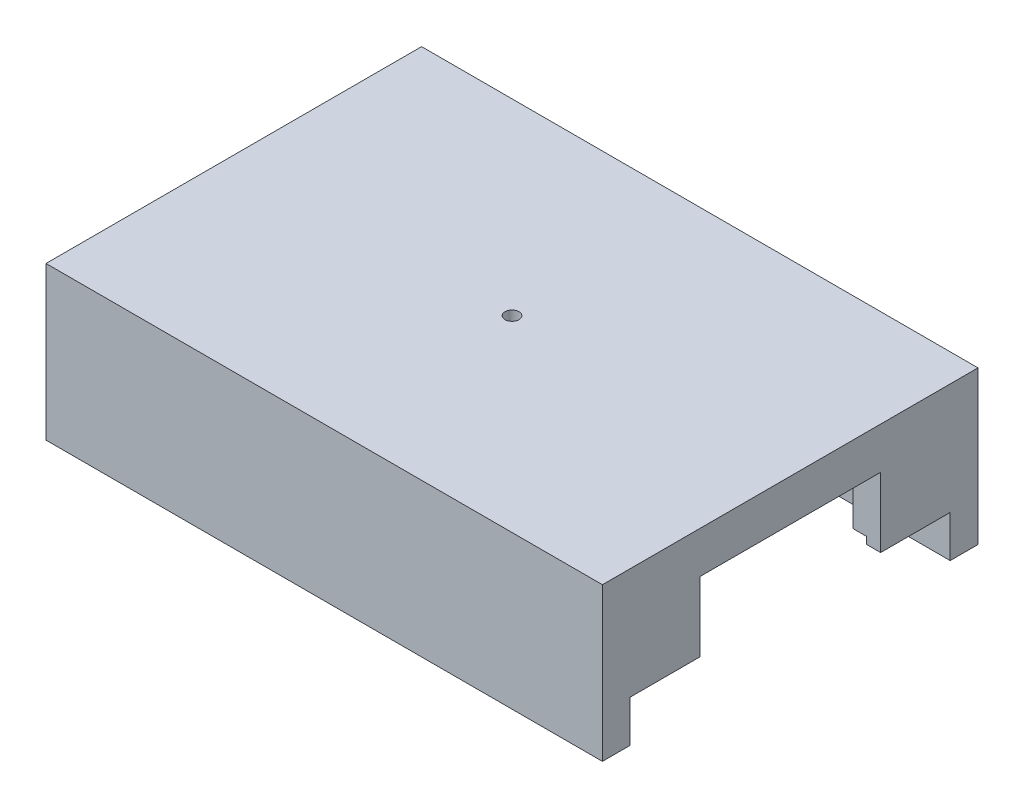
ISO-10303-21;
HEADER;
FILE_DESCRIPTION(('STEP AP214'),'2;1');
FILE_NAME('part.step','',(''),(''),'','','');
FILE_SCHEMA(('AUTOMOTIVE_DESIGN { 1 0 10303 214 1 1 1 1 }'));
ENDSEC;
DATA;
#1=APPLICATION_CONTEXT('core data for automotive mechanical design processes');
#2=APPLICATION_PROTOCOL_DEFINITION('international standard','automotive_design',2000,#1);
#3=PRODUCT_CONTEXT('',#1,'mechanical');
#4=PRODUCT('Part','Part','',(#3));
#5=PRODUCT_RELATED_PRODUCT_CATEGORY('part','',(#4));
#6=PRODUCT_DEFINITION_FORMATION('','',#4);
#7=PRODUCT_DEFINITION_CONTEXT('part definition',#1,'design');
#8=PRODUCT_DEFINITION('design','',#6,#7);
#9=PRODUCT_DEFINITION_SHAPE('','',#8);
#10=(LENGTH_UNIT() NAMED_UNIT(*) SI_UNIT(.MILLI.,.METRE.));
#11=(NAMED_UNIT(*) PLANE_ANGLE_UNIT() SI_UNIT($,.RADIAN.));
#12=(NAMED_UNIT(*) SI_UNIT($,.STERADIAN.) SOLID_ANGLE_UNIT());
#13=UNCERTAINTY_MEASURE_WITH_UNIT(LENGTH_MEASURE(1.E-05),#10,'distance_accuracy_value','');
#14=(GEOMETRIC_REPRESENTATION_CONTEXT(3) GLOBAL_UNCERTAINTY_ASSIGNED_CONTEXT((#13)) GLOBAL_UNIT_ASSIGNED_CONTEXT((#10,
#11,#12)) REPRESENTATION_CONTEXT('',''));
#15=CARTESIAN_POINT('',(0.,0.,0.));
#16=DIRECTION('',(0.,0.,1.));
#17=DIRECTION('',(1.,0.,0.));
#18=AXIS2_PLACEMENT_3D('',#15,#16,#17);
#19=CARTESIAN_POINT('',(0.,-11.,11.5));
#20=DIRECTION('',(0.,0.,-1.));
#21=DIRECTION('',(-1.,0.,0.));
#22=AXIS2_PLACEMENT_3D('',#19,#20,#21);
#23=PLANE('',#22);
#24=DIRECTION('',(-1.,0.,0.));
#25=VECTOR('',#24,1.);
#26=CARTESIAN_POINT('',(-20.,-8.,11.5));
#27=LINE('',#26,#25);
#28=CARTESIAN_POINT('',(-19.,-8.,11.5));
#29=VERTEX_POINT('',#28);
#30=CARTESIAN_POINT('',(-20.,-8.,11.5));
#31=VERTEX_POINT('',#30);
#32=EDGE_CURVE('E267',#29,#31,#27,.T.);
#33=ORIENTED_EDGE('',*,*,#32,.F.);
#34=DIRECTION('',(0.,-1.,0.));
#35=VECTOR('',#34,1.);
#36=CARTESIAN_POINT('',(-19.,0.,11.5));
#37=LINE('',#36,#35);
#38=CARTESIAN_POINT('',(-19.,-8.5,11.5));
#39=VERTEX_POINT('',#38);
#40=EDGE_CURVE('E51',#29,#39,#37,.T.);
#41=ORIENTED_EDGE('',*,*,#40,.T.);
#42=DIRECTION('',(-1.,0.,0.));
#43=VECTOR('',#42,1.);
#44=CARTESIAN_POINT('',(0.,-8.5,11.5));
#45=LINE('',#44,#43);
#46=CARTESIAN_POINT('',(19.,-8.5,11.5));
#47=VERTEX_POINT('',#46);
#48=EDGE_CURVE('E528',#47,#39,#45,.T.);
#49=ORIENTED_EDGE('',*,*,#48,.F.);
#50=DIRECTION('',(0.,-1.,0.));
#51=VECTOR('',#50,1.);
#52=CARTESIAN_POINT('',(19.,0.,11.5));
#53=LINE('',#52,#51);
#54=CARTESIAN_POINT('',(19.,-8.,11.5));
#55=VERTEX_POINT('',#54);
#56=EDGE_CURVE('E539',#55,#47,#53,.T.);
#57=ORIENTED_EDGE('',*,*,#56,.F.);
#58=DIRECTION('',(-1.,0.,0.));
#59=VECTOR('',#58,1.);
#60=CARTESIAN_POINT('',(20.,-8.,11.5));
#61=LINE('',#60,#59);
#62=CARTESIAN_POINT('',(20.,-8.,11.5));
#63=VERTEX_POINT('',#62);
#64=EDGE_CURVE('E330',#63,#55,#61,.T.);
#65=ORIENTED_EDGE('',*,*,#64,.F.);
#66=DIRECTION('',(0.,1.,0.));
#67=VECTOR('',#66,1.);
#68=CARTESIAN_POINT('',(20.,-11.,11.5));
#69=LINE('',#68,#67);
#70=CARTESIAN_POINT('',(20.,-11.,11.5));
#71=VERTEX_POINT('',#70);
#72=EDGE_CURVE('E365',#71,#63,#69,.T.);
#73=ORIENTED_EDGE('',*,*,#72,.F.);
#74=DIRECTION('',(-1.,0.,0.));
#75=VECTOR('',#74,1.);
#76=CARTESIAN_POINT('',(0.,-11.,11.5));
#77=LINE('',#76,#75);
#78=CARTESIAN_POINT('',(-20.,-11.,11.5));
#79=VERTEX_POINT('',#78);
#80=EDGE_CURVE('E347',#71,#79,#77,.T.);
#81=ORIENTED_EDGE('',*,*,#80,.T.);
#82=DIRECTION('',(0.,1.,0.));
#83=VECTOR('',#82,1.);
#84=CARTESIAN_POINT('',(-20.,-11.,11.5));
#85=LINE('',#84,#83);
#86=EDGE_CURVE('E356',#79,#31,#85,.T.);
#87=ORIENTED_EDGE('',*,*,#86,.T.);
#88=EDGE_LOOP('',(#33,#41,#49,#57,#65,#73,#81,#87));
#89=FACE_BOUND('',#88,.T.);
#90=ADVANCED_FACE('F34',(#89),#23,.T.);
#91=DIRECTION('',(0.,1.,0.));
#92=VECTOR('',#91,1.);
#93=CARTESIAN_POINT('',(18.,-8.,11.5));
#94=LINE('',#93,#92);
#95=CARTESIAN_POINT('',(18.,-7.5,11.5));
#96=VERTEX_POINT('',#95);
#97=CARTESIAN_POINT('',(18.,-3.,11.5));
#98=VERTEX_POINT('',#97);
#99=EDGE_CURVE('E344',#96,#98,#94,.T.);
#100=ORIENTED_EDGE('',*,*,#99,.F.);
#101=DIRECTION('',(-1.,0.,0.));
#102=VECTOR('',#101,1.);
#103=CARTESIAN_POINT('',(0.,-7.5,11.5));
#104=LINE('',#103,#102);
#105=CARTESIAN_POINT('',(-18.,-7.5,11.5));
#106=VERTEX_POINT('',#105);
#107=EDGE_CURVE('E510',#96,#106,#104,.T.);
#108=ORIENTED_EDGE('',*,*,#107,.T.);
#109=DIRECTION('',(0.,1.,0.));
#110=VECTOR('',#109,1.);
#111=CARTESIAN_POINT('',(-18.,-8.,11.5));
#112=LINE('',#111,#110);
#113=CARTESIAN_POINT('',(-18.,-3.,11.5));
#114=VERTEX_POINT('',#113);
#115=EDGE_CURVE('E269',#106,#114,#112,.T.);
#116=ORIENTED_EDGE('',*,*,#115,.T.);
#117=DIRECTION('',(-1.,0.,0.));
#118=VECTOR('',#117,1.);
#119=CARTESIAN_POINT('',(0.,-3.,11.5));
#120=LINE('',#119,#118);
#121=EDGE_CURVE('E346',#98,#114,#120,.T.);
#122=ORIENTED_EDGE('',*,*,#121,.F.);
#123=EDGE_LOOP('',(#100,#108,#116,#122));
#124=FACE_BOUND('',#123,.T.);
#125=ADVANCED_FACE('F423',(#124),#23,.T.);
#126=CARTESIAN_POINT('',(18.,-8.,11.5));
#127=DIRECTION('',(1.,0.,0.));
#128=DIRECTION('',(0.,0.,-1.));
#129=AXIS2_PLACEMENT_3D('',#126,#127,#128);
#130=PLANE('',#129);
#131=DIRECTION('',(0.,0.,-1.));
#132=VECTOR('',#131,1.);
#133=CARTESIAN_POINT('',(18.,-7.5,-13.501));
#134=LINE('',#133,#132);
#135=CARTESIAN_POINT('',(18.,-7.5,6.5));
#136=VERTEX_POINT('',#135);
#137=EDGE_CURVE('E508',#96,#136,#134,.T.);
#138=ORIENTED_EDGE('',*,*,#137,.F.);
#139=ORIENTED_EDGE('',*,*,#99,.T.);
#140=DIRECTION('',(0.,0.,-1.));
#141=VECTOR('',#140,1.);
#142=CARTESIAN_POINT('',(18.,-3.,11.5));
#143=LINE('',#142,#141);
#144=CARTESIAN_POINT('',(18.,-3.,6.5));
#145=VERTEX_POINT('',#144);
#146=EDGE_CURVE('E327',#98,#145,#143,.T.);
#147=ORIENTED_EDGE('',*,*,#146,.T.);
#148=DIRECTION('',(0.,1.,0.));
#149=VECTOR('',#148,1.);
#150=CARTESIAN_POINT('',(18.,-8.,6.5));
#151=LINE('',#150,#149);
#152=EDGE_CURVE('E342',#136,#145,#151,.T.);
#153=ORIENTED_EDGE('',*,*,#152,.F.);
#154=EDGE_LOOP('',(#138,#139,#147,#153));
#155=FACE_BOUND('',#154,.T.);
#156=ADVANCED_FACE('F429',(#155),#130,.F.);
#157=CARTESIAN_POINT('',(-20.,-8.,6.5));
#158=DIRECTION('',(0.,0.,1.));
#159=DIRECTION('',(1.,0.,0.));
#160=AXIS2_PLACEMENT_3D('',#157,#158,#159);
#161=PLANE('',#160);
#162=DIRECTION('',(0.,1.,0.));
#163=VECTOR('',#162,1.);
#164=CARTESIAN_POINT('',(-19.,0.,6.5));
#165=LINE('',#164,#163);
#166=CARTESIAN_POINT('',(-19.,-8.,6.5));
#167=VERTEX_POINT('',#166);
#168=CARTESIAN_POINT('',(-19.,-7.5,6.5));
#169=VERTEX_POINT('',#168);
#170=EDGE_CURVE('E247',#167,#169,#165,.T.);
#171=ORIENTED_EDGE('',*,*,#170,.F.);
#172=DIRECTION('',(1.,0.,0.));
#173=VECTOR('',#172,1.);
#174=CARTESIAN_POINT('',(-20.,-8.,6.5));
#175=LINE('',#174,#173);
#176=CARTESIAN_POINT('',(-20.,-8.,6.5));
#177=VERTEX_POINT('',#176);
#178=EDGE_CURVE('E258',#177,#167,#175,.T.);
#179=ORIENTED_EDGE('',*,*,#178,.F.);
#180=DIRECTION('',(0.,1.,0.));
#181=VECTOR('',#180,1.);
#182=CARTESIAN_POINT('',(-20.,-8.,6.5));
#183=LINE('',#182,#181);
#184=CARTESIAN_POINT('',(-20.,-3.,6.5));
#185=VERTEX_POINT('',#184);
#186=EDGE_CURVE('E284',#177,#185,#183,.T.);
#187=ORIENTED_EDGE('',*,*,#186,.T.);
#188=DIRECTION('',(1.,0.,0.));
#189=VECTOR('',#188,1.);
#190=CARTESIAN_POINT('',(-20.,-3.,6.5));
#191=LINE('',#190,#189);
#192=CARTESIAN_POINT('',(-18.,-3.,6.5));
#193=VERTEX_POINT('',#192);
#194=EDGE_CURVE('E275',#185,#193,#191,.T.);
#195=ORIENTED_EDGE('',*,*,#194,.T.);
#196=DIRECTION('',(0.,1.,0.));
#197=VECTOR('',#196,1.);
#198=CARTESIAN_POINT('',(-18.,-8.,6.5));
#199=LINE('',#198,#197);
#200=CARTESIAN_POINT('',(-18.,-7.5,6.5));
#201=VERTEX_POINT('',#200);
#202=EDGE_CURVE('E282',#201,#193,#199,.T.);
#203=ORIENTED_EDGE('',*,*,#202,.F.);
#204=DIRECTION('',(1.,0.,0.));
#205=VECTOR('',#204,1.);
#206=CARTESIAN_POINT('',(0.,-7.5,6.49999999999999));
#207=LINE('',#206,#205);
#208=EDGE_CURVE('E253',#169,#201,#207,.T.);
#209=ORIENTED_EDGE('',*,*,#208,.F.);
#210=EDGE_LOOP('',(#171,#179,#187,#195,#203,#209));
#211=FACE_BOUND('',#210,.T.);
#212=ADVANCED_FACE('F256',(#211),#161,.F.);
#213=CARTESIAN_POINT('',(-18.,-8.,11.5));
#214=DIRECTION('',(-1.,0.,0.));
#215=DIRECTION('',(0.,0.,1.));
#216=AXIS2_PLACEMENT_3D('',#213,#214,#215);
#217=PLANE('',#216);
#218=DIRECTION('',(0.,0.,1.));
#219=VECTOR('',#218,1.);
#220=CARTESIAN_POINT('',(-18.,-7.5,-13.501));
#221=LINE('',#220,#219);
#222=EDGE_CURVE('E261',#201,#106,#221,.T.);
#223=ORIENTED_EDGE('',*,*,#222,.F.);
#224=ORIENTED_EDGE('',*,*,#202,.T.);
#225=DIRECTION('',(0.,0.,1.));
#226=VECTOR('',#225,1.);
#227=CARTESIAN_POINT('',(-18.,-3.,11.5));
#228=LINE('',#227,#226);
#229=EDGE_CURVE('E271',#193,#114,#228,.T.);
#230=ORIENTED_EDGE('',*,*,#229,.T.);
#231=ORIENTED_EDGE('',*,*,#115,.F.);
#232=EDGE_LOOP('',(#223,#224,#230,#231));
#233=FACE_BOUND('',#232,.T.);
#234=ADVANCED_FACE('F514',(#233),#217,.F.);
#235=CARTESIAN_POINT('',(0.,-8.,0.));
#236=DIRECTION('',(0.,-1.,0.));
#237=DIRECTION('',(0.,0.,-1.));
#238=AXIS2_PLACEMENT_3D('',#235,#236,#237);
#239=PLANE('',#238);
#240=ORIENTED_EDGE('',*,*,#178,.T.);
#241=DIRECTION('',(0.,0.,1.));
#242=VECTOR('',#241,1.);
#243=CARTESIAN_POINT('',(-19.,-8.,-13.501));
#244=LINE('',#243,#242);
#245=EDGE_CURVE('E243',#167,#29,#244,.T.);
#246=ORIENTED_EDGE('',*,*,#245,.T.);
#247=ORIENTED_EDGE('',*,*,#32,.T.);
#248=DIRECTION('',(0.,0.,-1.));
#249=VECTOR('',#248,1.);
#250=CARTESIAN_POINT('',(-20.,-8.,11.5));
#251=LINE('',#250,#249);
#252=EDGE_CURVE('E265',#31,#177,#251,.T.);
#253=ORIENTED_EDGE('',*,*,#252,.T.);
#254=EDGE_LOOP('',(#240,#246,#247,#253));
#255=FACE_BOUND('',#254,.T.);
#256=ADVANCED_FACE('F263',(#255),#239,.T.);
#257=CARTESIAN_POINT('',(0.,-11.,-11.5));
#258=DIRECTION('',(0.,0.,-1.));
#259=DIRECTION('',(-1.,0.,0.));
#260=AXIS2_PLACEMENT_3D('',#257,#258,#259);
#261=PLANE('',#260);
#262=DIRECTION('',(0.,1.,0.));
#263=VECTOR('',#262,1.);
#264=CARTESIAN_POINT('',(-18.,-8.,-11.5));
#265=LINE('',#264,#263);
#266=CARTESIAN_POINT('',(-18.,-7.5,-11.5));
#267=VERTEX_POINT('',#266);
#268=CARTESIAN_POINT('',(-18.,-3.,-11.5));
#269=VERTEX_POINT('',#268);
#270=EDGE_CURVE('E305',#267,#269,#265,.T.);
#271=ORIENTED_EDGE('',*,*,#270,.F.);
#272=DIRECTION('',(-1.,0.,0.));
#273=VECTOR('',#272,1.);
#274=CARTESIAN_POINT('',(0.,-7.5,-11.5));
#275=LINE('',#274,#273);
#276=CARTESIAN_POINT('',(18.,-7.5,-11.5));
#277=VERTEX_POINT('',#276);
#278=EDGE_CURVE('E474',#277,#267,#275,.T.);
#279=ORIENTED_EDGE('',*,*,#278,.F.);
#280=DIRECTION('',(0.,1.,0.));
#281=VECTOR('',#280,1.);
#282=CARTESIAN_POINT('',(18.,-8.,-11.5));
#283=LINE('',#282,#281);
#284=CARTESIAN_POINT('',(18.,-3.,-11.5));
#285=VERTEX_POINT('',#284);
#286=EDGE_CURVE('E317',#277,#285,#283,.T.);
#287=ORIENTED_EDGE('',*,*,#286,.T.);
#288=DIRECTION('',(-1.,0.,0.));
#289=VECTOR('',#288,1.);
#290=CARTESIAN_POINT('',(0.,-3.,-11.5));
#291=LINE('',#290,#289);
#292=EDGE_CURVE('E368',#285,#269,#291,.T.);
#293=ORIENTED_EDGE('',*,*,#292,.T.);
#294=EDGE_LOOP('',(#271,#279,#287,#293));
#295=FACE_BOUND('',#294,.T.);
#296=ADVANCED_FACE('F442',(#295),#261,.F.);
#297=CARTESIAN_POINT('',(0.,-8.,0.));
#298=DIRECTION('',(0.,-1.,0.));
#299=DIRECTION('',(0.,0.,-1.));
#300=AXIS2_PLACEMENT_3D('',#297,#298,#299);
#301=PLANE('',#300);
#302=DIRECTION('',(-1.,0.,0.));
#303=VECTOR('',#302,1.);
#304=CARTESIAN_POINT('',(20.,-8.,-6.5));
#305=LINE('',#304,#303);
#306=CARTESIAN_POINT('',(20.,-8.,-6.5));
#307=VERTEX_POINT('',#306);
#308=CARTESIAN_POINT('',(19.,-8.,-6.5));
#309=VERTEX_POINT('',#308);
#310=EDGE_CURVE('E311',#307,#309,#305,.T.);
#311=ORIENTED_EDGE('',*,*,#310,.T.);
#312=DIRECTION('',(0.,0.,-1.));
#313=VECTOR('',#312,1.);
#314=CARTESIAN_POINT('',(19.,-8.,13.501));
#315=LINE('',#314,#313);
#316=CARTESIAN_POINT('',(19.,-8.,-11.5));
#317=VERTEX_POINT('',#316);
#318=EDGE_CURVE('E555',#309,#317,#315,.T.);
#319=ORIENTED_EDGE('',*,*,#318,.T.);
#320=DIRECTION('',(1.,0.,0.));
#321=VECTOR('',#320,1.);
#322=CARTESIAN_POINT('',(20.,-8.,-11.5));
#323=LINE('',#322,#321);
#324=CARTESIAN_POINT('',(20.,-8.,-11.5));
#325=VERTEX_POINT('',#324);
#326=EDGE_CURVE('E315',#317,#325,#323,.T.);
#327=ORIENTED_EDGE('',*,*,#326,.T.);
#328=DIRECTION('',(0.,0.,1.));
#329=VECTOR('',#328,1.);
#330=CARTESIAN_POINT('',(20.,-8.,-11.5));
#331=LINE('',#330,#329);
#332=EDGE_CURVE('E308',#325,#307,#331,.T.);
#333=ORIENTED_EDGE('',*,*,#332,.T.);
#334=EDGE_LOOP('',(#311,#319,#327,#333));
#335=FACE_BOUND('',#334,.T.);
#336=ADVANCED_FACE('F444',(#335),#301,.T.);
#337=CARTESIAN_POINT('',(0.,-3.,0.));
#338=DIRECTION('',(0.,1.,0.));
#339=DIRECTION('',(0.,0.,1.));
#340=AXIS2_PLACEMENT_3D('',#337,#338,#339);
#341=PLANE('',#340);
#342=CARTESIAN_POINT('',(0.,-3.,0.));
#343=DIRECTION('',(0.,1.,0.));
#344=DIRECTION('',(0.,0.,1.));
#345=AXIS2_PLACEMENT_3D('',#342,#343,#344);
#346=CIRCLE('',#345,0.5);
#347=CARTESIAN_POINT('',(0.,-3.,0.5));
#348=VERTEX_POINT('',#347);
#349=EDGE_CURVE('E11',#348,#348,#346,.T.);
#350=ORIENTED_EDGE('',*,*,#349,.T.);
#351=EDGE_LOOP('',(#350));
#352=FACE_BOUND('',#351,.T.);
#353=ORIENTED_EDGE('',*,*,#194,.F.);
#354=DIRECTION('',(0.,0.,-1.));
#355=VECTOR('',#354,1.);
#356=CARTESIAN_POINT('',(-20.,-3.,0.));
#357=LINE('',#356,#355);
#358=CARTESIAN_POINT('',(-20.,-3.,-6.5));
#359=VERTEX_POINT('',#358);
#360=EDGE_CURVE('E391',#185,#359,#357,.T.);
#361=ORIENTED_EDGE('',*,*,#360,.T.);
#362=DIRECTION('',(-1.,0.,0.));
#363=VECTOR('',#362,1.);
#364=CARTESIAN_POINT('',(-20.,-3.,-6.5));
#365=LINE('',#364,#363);
#366=CARTESIAN_POINT('',(-18.,-3.,-6.5));
#367=VERTEX_POINT('',#366);
#368=EDGE_CURVE('E291',#367,#359,#365,.T.);
#369=ORIENTED_EDGE('',*,*,#368,.F.);
#370=DIRECTION('',(0.,0.,1.));
#371=VECTOR('',#370,1.);
#372=CARTESIAN_POINT('',(-18.,-3.,-11.5));
#373=LINE('',#372,#371);
#374=EDGE_CURVE('E286',#269,#367,#373,.T.);
#375=ORIENTED_EDGE('',*,*,#374,.F.);
#376=ORIENTED_EDGE('',*,*,#292,.F.);
#377=DIRECTION('',(0.,0.,-1.));
#378=VECTOR('',#377,1.);
#379=CARTESIAN_POINT('',(18.,-3.,-11.5));
#380=LINE('',#379,#378);
#381=CARTESIAN_POINT('',(18.,-3.,-6.5));
#382=VERTEX_POINT('',#381);
#383=EDGE_CURVE('E312',#382,#285,#380,.T.);
#384=ORIENTED_EDGE('',*,*,#383,.F.);
#385=DIRECTION('',(-1.,0.,0.));
#386=VECTOR('',#385,1.);
#387=CARTESIAN_POINT('',(20.,-3.,-6.5));
#388=LINE('',#387,#386);
#389=CARTESIAN_POINT('',(20.,-3.,-6.5));
#390=VERTEX_POINT('',#389);
#391=EDGE_CURVE('E307',#390,#382,#388,.T.);
#392=ORIENTED_EDGE('',*,*,#391,.F.);
#393=DIRECTION('',(0.,0.,-1.));
#394=VECTOR('',#393,1.);
#395=CARTESIAN_POINT('',(20.,-3.,0.));
#396=LINE('',#395,#394);
#397=CARTESIAN_POINT('',(20.,-3.,6.5));
#398=VERTEX_POINT('',#397);
#399=EDGE_CURVE('E43',#398,#390,#396,.T.);
#400=ORIENTED_EDGE('',*,*,#399,.F.);
#401=DIRECTION('',(1.,0.,0.));
#402=VECTOR('',#401,1.);
#403=CARTESIAN_POINT('',(20.,-3.,6.5));
#404=LINE('',#403,#402);
#405=EDGE_CURVE('E331',#145,#398,#404,.T.);
#406=ORIENTED_EDGE('',*,*,#405,.F.);
#407=ORIENTED_EDGE('',*,*,#146,.F.);
#408=ORIENTED_EDGE('',*,*,#121,.T.);
#409=ORIENTED_EDGE('',*,*,#229,.F.);
#410=EDGE_LOOP('',(#353,#361,#369,#375,#376,#384,#392,#400,#406,#407,#408,#409));
#411=FACE_BOUND('',#410,.T.);
#412=ADVANCED_FACE('F440',(#352,#411),#341,.F.);
#413=DIRECTION('',(-1.,0.,0.));
#414=VECTOR('',#413,1.);
#415=CARTESIAN_POINT('',(0.,-8.5,-11.5));
#416=LINE('',#415,#414);
#417=CARTESIAN_POINT('',(19.,-8.5,-11.5));
#418=VERTEX_POINT('',#417);
#419=CARTESIAN_POINT('',(-19.,-8.5,-11.5));
#420=VERTEX_POINT('',#419);
#421=EDGE_CURVE('E579',#418,#420,#416,.T.);
#422=ORIENTED_EDGE('',*,*,#421,.T.);
#423=DIRECTION('',(0.,-1.,0.));
#424=VECTOR('',#423,1.);
#425=CARTESIAN_POINT('',(-19.,0.,-11.5));
#426=LINE('',#425,#424);
#427=CARTESIAN_POINT('',(-19.,-8.,-11.5));
#428=VERTEX_POINT('',#427);
#429=EDGE_CURVE('E566',#428,#420,#426,.T.);
#430=ORIENTED_EDGE('',*,*,#429,.F.);
#431=DIRECTION('',(1.,0.,0.));
#432=VECTOR('',#431,1.);
#433=CARTESIAN_POINT('',(-20.,-8.,-11.5));
#434=LINE('',#433,#432);
#435=CARTESIAN_POINT('',(-20.,-8.,-11.5));
#436=VERTEX_POINT('',#435);
#437=EDGE_CURVE('E287',#436,#428,#434,.T.);
#438=ORIENTED_EDGE('',*,*,#437,.F.);
#439=DIRECTION('',(0.,1.,0.));
#440=VECTOR('',#439,1.);
#441=CARTESIAN_POINT('',(-20.,-11.,-11.5));
#442=LINE('',#441,#440);
#443=CARTESIAN_POINT('',(-20.,-11.,-11.5));
#444=VERTEX_POINT('',#443);
#445=EDGE_CURVE('E382',#444,#436,#442,.T.);
#446=ORIENTED_EDGE('',*,*,#445,.F.);
#447=DIRECTION('',(-1.,0.,0.));
#448=VECTOR('',#447,1.);
#449=CARTESIAN_POINT('',(0.,-11.,-11.5));
#450=LINE('',#449,#448);
#451=CARTESIAN_POINT('',(20.,-11.,-11.5));
#452=VERTEX_POINT('',#451);
#453=EDGE_CURVE('E374',#452,#444,#450,.T.);
#454=ORIENTED_EDGE('',*,*,#453,.F.);
#455=DIRECTION('',(0.,1.,0.));
#456=VECTOR('',#455,1.);
#457=CARTESIAN_POINT('',(20.,-11.,-11.5));
#458=LINE('',#457,#456);
#459=EDGE_CURVE('E385',#452,#325,#458,.T.);
#460=ORIENTED_EDGE('',*,*,#459,.T.);
#461=ORIENTED_EDGE('',*,*,#326,.F.);
#462=DIRECTION('',(0.,-1.,0.));
#463=VECTOR('',#462,1.);
#464=CARTESIAN_POINT('',(19.,0.,-11.5));
#465=LINE('',#464,#463);
#466=EDGE_CURVE('E582',#317,#418,#465,.T.);
#467=ORIENTED_EDGE('',*,*,#466,.T.);
#468=EDGE_LOOP('',(#422,#430,#438,#446,#454,#460,#461,#467));
#469=FACE_BOUND('',#468,.T.);
#470=ADVANCED_FACE('F438',(#469),#261,.F.);
#471=CARTESIAN_POINT('',(-20.,-3.,0.));
#472=DIRECTION('',(1.,0.,0.));
#473=DIRECTION('',(0.,0.,-1.));
#474=AXIS2_PLACEMENT_3D('',#471,#472,#473);
#475=PLANE('',#474);
#476=DIRECTION('',(0.,0.,-1.));
#477=VECTOR('',#476,1.);
#478=CARTESIAN_POINT('',(-20.,0.,0.));
#479=LINE('',#478,#477);
#480=CARTESIAN_POINT('',(-20.,0.,13.5));
#481=VERTEX_POINT('',#480);
#482=CARTESIAN_POINT('',(-20.,0.,-13.5));
#483=VERTEX_POINT('',#482);
#484=EDGE_CURVE('E390',#481,#483,#479,.T.);
#485=ORIENTED_EDGE('',*,*,#484,.T.);
#486=DIRECTION('',(0.,1.,0.));
#487=VECTOR('',#486,1.);
#488=CARTESIAN_POINT('',(-20.,-11.,-13.5));
#489=LINE('',#488,#487);
#490=CARTESIAN_POINT('',(-20.,-11.,-13.5));
#491=VERTEX_POINT('',#490);
#492=EDGE_CURVE('E378',#491,#483,#489,.T.);
#493=ORIENTED_EDGE('',*,*,#492,.F.);
#494=DIRECTION('',(0.,0.,-1.));
#495=VECTOR('',#494,1.);
#496=CARTESIAN_POINT('',(-20.,-11.,0.));
#497=LINE('',#496,#495);
#498=EDGE_CURVE('E376',#444,#491,#497,.T.);
#499=ORIENTED_EDGE('',*,*,#498,.F.);
#500=ORIENTED_EDGE('',*,*,#445,.T.);
#501=DIRECTION('',(0.,0.,-1.));
#502=VECTOR('',#501,1.);
#503=CARTESIAN_POINT('',(-20.,-8.,-11.5));
#504=LINE('',#503,#502);
#505=CARTESIAN_POINT('',(-20.,-8.,-6.5));
#506=VERTEX_POINT('',#505);
#507=EDGE_CURVE('E293',#506,#436,#504,.T.);
#508=ORIENTED_EDGE('',*,*,#507,.F.);
#509=DIRECTION('',(0.,1.,0.));
#510=VECTOR('',#509,1.);
#511=CARTESIAN_POINT('',(-20.,-8.,-6.5));
#512=LINE('',#511,#510);
#513=EDGE_CURVE('E296',#506,#359,#512,.T.);
#514=ORIENTED_EDGE('',*,*,#513,.T.);
#515=ORIENTED_EDGE('',*,*,#360,.F.);
#516=ORIENTED_EDGE('',*,*,#186,.F.);
#517=ORIENTED_EDGE('',*,*,#252,.F.);
#518=ORIENTED_EDGE('',*,*,#86,.F.);
#519=DIRECTION('',(0.,0.,-1.));
#520=VECTOR('',#519,1.);
#521=CARTESIAN_POINT('',(-20.,-11.,0.));
#522=LINE('',#521,#520);
#523=CARTESIAN_POINT('',(-20.,-11.,13.5));
#524=VERTEX_POINT('',#523);
#525=EDGE_CURVE('E354',#524,#79,#522,.T.);
#526=ORIENTED_EDGE('',*,*,#525,.F.);
#527=DIRECTION('',(0.,1.,0.));
#528=VECTOR('',#527,1.);
#529=CARTESIAN_POINT('',(-20.,-11.,13.5));
#530=LINE('',#529,#528);
#531=EDGE_CURVE('E361',#524,#481,#530,.T.);
#532=ORIENTED_EDGE('',*,*,#531,.T.);
#533=EDGE_LOOP('',(#485,#493,#499,#500,#508,#514,#515,#516,#517,#518,#526,#532));
#534=FACE_BOUND('',#533,.T.);
#535=ADVANCED_FACE('F36',(#534),#475,.F.);
#536=CARTESIAN_POINT('',(20.,-3.,0.));
#537=DIRECTION('',(1.,0.,0.));
#538=DIRECTION('',(0.,0.,-1.));
#539=AXIS2_PLACEMENT_3D('',#536,#537,#538);
#540=PLANE('',#539);
#541=DIRECTION('',(0.,1.,0.));
#542=VECTOR('',#541,1.);
#543=CARTESIAN_POINT('',(20.,-11.,-13.5));
#544=LINE('',#543,#542);
#545=CARTESIAN_POINT('',(20.,-11.,-13.5));
#546=VERTEX_POINT('',#545);
#547=CARTESIAN_POINT('',(20.,0.,-13.5));
#548=VERTEX_POINT('',#547);
#549=EDGE_CURVE('E388',#546,#548,#544,.T.);
#550=ORIENTED_EDGE('',*,*,#549,.T.);
#551=DIRECTION('',(0.,0.,-1.));
#552=VECTOR('',#551,1.);
#553=CARTESIAN_POINT('',(20.,0.,0.));
#554=LINE('',#553,#552);
#555=CARTESIAN_POINT('',(20.,0.,13.5));
#556=VERTEX_POINT('',#555);
#557=EDGE_CURVE('E396',#556,#548,#554,.T.);
#558=ORIENTED_EDGE('',*,*,#557,.F.);
#559=DIRECTION('',(0.,1.,0.));
#560=VECTOR('',#559,1.);
#561=CARTESIAN_POINT('',(20.,-11.,13.5));
#562=LINE('',#561,#560);
#563=CARTESIAN_POINT('',(20.,-11.,13.5));
#564=VERTEX_POINT('',#563);
#565=EDGE_CURVE('E363',#564,#556,#562,.T.);
#566=ORIENTED_EDGE('',*,*,#565,.F.);
#567=DIRECTION('',(0.,0.,1.));
#568=VECTOR('',#567,1.);
#569=CARTESIAN_POINT('',(20.,-11.,0.));
#570=LINE('',#569,#568);
#571=EDGE_CURVE('E350',#71,#564,#570,.T.);
#572=ORIENTED_EDGE('',*,*,#571,.F.);
#573=ORIENTED_EDGE('',*,*,#72,.T.);
#574=DIRECTION('',(0.,0.,1.));
#575=VECTOR('',#574,1.);
#576=CARTESIAN_POINT('',(20.,-8.,11.5));
#577=LINE('',#576,#575);
#578=CARTESIAN_POINT('',(20.,-8.,6.5));
#579=VERTEX_POINT('',#578);
#580=EDGE_CURVE('E328',#579,#63,#577,.T.);
#581=ORIENTED_EDGE('',*,*,#580,.F.);
#582=DIRECTION('',(0.,1.,0.));
#583=VECTOR('',#582,1.);
#584=CARTESIAN_POINT('',(20.,-8.,6.5));
#585=LINE('',#584,#583);
#586=EDGE_CURVE('E336',#579,#398,#585,.T.);
#587=ORIENTED_EDGE('',*,*,#586,.T.);
#588=ORIENTED_EDGE('',*,*,#399,.T.);
#589=DIRECTION('',(0.,1.,0.));
#590=VECTOR('',#589,1.);
#591=CARTESIAN_POINT('',(20.,-8.,-6.5));
#592=LINE('',#591,#590);
#593=EDGE_CURVE('E325',#307,#390,#592,.T.);
#594=ORIENTED_EDGE('',*,*,#593,.F.);
#595=ORIENTED_EDGE('',*,*,#332,.F.);
#596=ORIENTED_EDGE('',*,*,#459,.F.);
#597=DIRECTION('',(0.,0.,1.));
#598=VECTOR('',#597,1.);
#599=CARTESIAN_POINT('',(20.,-11.,0.));
#600=LINE('',#599,#598);
#601=EDGE_CURVE('E372',#546,#452,#600,.T.);
#602=ORIENTED_EDGE('',*,*,#601,.F.);
#603=EDGE_LOOP('',(#550,#558,#566,#572,#573,#581,#587,#588,#594,#595,#596,#602));
#604=FACE_BOUND('',#603,.T.);
#605=ADVANCED_FACE('F418',(#604),#540,.T.);
#606=CARTESIAN_POINT('',(0.,-3.,0.));
#607=DIRECTION('',(0.,1.,0.));
#608=DIRECTION('',(0.,0.,1.));
#609=AXIS2_PLACEMENT_3D('',#606,#607,#608);
#610=CYLINDRICAL_SURFACE('',#609,0.5);
#611=ORIENTED_EDGE('',*,*,#349,.F.);
#612=EDGE_LOOP('',(#611));
#613=FACE_BOUND('',#612,.T.);
#614=CARTESIAN_POINT('',(0.,0.,0.));
#615=DIRECTION('',(0.,1.,0.));
#616=DIRECTION('',(0.,0.,1.));
#617=AXIS2_PLACEMENT_3D('',#614,#615,#616);
#618=CIRCLE('',#617,0.5);
#619=CARTESIAN_POINT('',(0.,0.,0.5));
#620=VERTEX_POINT('',#619);
#621=EDGE_CURVE('E38',#620,#620,#618,.T.);
#622=ORIENTED_EDGE('',*,*,#621,.T.);
#623=EDGE_LOOP('',(#622));
#624=FACE_BOUND('',#623,.T.);
#625=ADVANCED_FACE('F405',(#613,#624),#610,.F.);
#626=CARTESIAN_POINT('',(0.,0.,0.));
#627=DIRECTION('',(0.,1.,0.));
#628=DIRECTION('',(0.,0.,1.));
#629=AXIS2_PLACEMENT_3D('',#626,#627,#628);
#630=PLANE('',#629);
#631=DIRECTION('',(-1.,0.,0.));
#632=VECTOR('',#631,1.);
#633=CARTESIAN_POINT('',(20.,0.,-13.5));
#634=LINE('',#633,#632);
#635=EDGE_CURVE('E588',#548,#483,#634,.T.);
#636=ORIENTED_EDGE('',*,*,#635,.T.);
#637=ORIENTED_EDGE('',*,*,#484,.F.);
#638=DIRECTION('',(1.,0.,0.));
#639=VECTOR('',#638,1.);
#640=CARTESIAN_POINT('',(20.,0.,13.5));
#641=LINE('',#640,#639);
#642=EDGE_CURVE('E278',#481,#556,#641,.T.);
#643=ORIENTED_EDGE('',*,*,#642,.T.);
#644=ORIENTED_EDGE('',*,*,#557,.T.);
#645=EDGE_LOOP('',(#636,#637,#643,#644));
#646=FACE_BOUND('',#645,.T.);
#647=ORIENTED_EDGE('',*,*,#621,.F.);
#648=EDGE_LOOP('',(#647));
#649=FACE_BOUND('',#648,.T.);
#650=ADVANCED_FACE('F407',(#646,#649),#630,.T.);
#651=CARTESIAN_POINT('',(0.,-11.,-13.5));
#652=DIRECTION('',(0.,0.,-1.));
#653=DIRECTION('',(-1.,0.,0.));
#654=AXIS2_PLACEMENT_3D('',#651,#652,#653);
#655=PLANE('',#654);
#656=ORIENTED_EDGE('',*,*,#492,.T.);
#657=ORIENTED_EDGE('',*,*,#635,.F.);
#658=ORIENTED_EDGE('',*,*,#549,.F.);
#659=DIRECTION('',(-1.,0.,0.));
#660=VECTOR('',#659,1.);
#661=CARTESIAN_POINT('',(0.,-11.,-13.5));
#662=LINE('',#661,#660);
#663=EDGE_CURVE('E369',#546,#491,#662,.T.);
#664=ORIENTED_EDGE('',*,*,#663,.T.);
#665=EDGE_LOOP('',(#656,#657,#658,#664));
#666=FACE_BOUND('',#665,.T.);
#667=ADVANCED_FACE('F409',(#666),#655,.T.);
#668=CARTESIAN_POINT('',(0.,-11.,0.));
#669=DIRECTION('',(0.,-1.,0.));
#670=DIRECTION('',(0.,0.,-1.));
#671=AXIS2_PLACEMENT_3D('',#668,#669,#670);
#672=PLANE('',#671);
#673=ORIENTED_EDGE('',*,*,#663,.F.);
#674=ORIENTED_EDGE('',*,*,#601,.T.);
#675=ORIENTED_EDGE('',*,*,#453,.T.);
#676=ORIENTED_EDGE('',*,*,#498,.T.);
#677=EDGE_LOOP('',(#673,#674,#675,#676));
#678=FACE_BOUND('',#677,.T.);
#679=ADVANCED_FACE('F415',(#678),#672,.T.);
#680=CARTESIAN_POINT('',(0.,-11.,13.5));
#681=DIRECTION('',(0.,0.,-1.));
#682=DIRECTION('',(-1.,0.,0.));
#683=AXIS2_PLACEMENT_3D('',#680,#681,#682);
#684=PLANE('',#683);
#685=ORIENTED_EDGE('',*,*,#565,.T.);
#686=ORIENTED_EDGE('',*,*,#642,.F.);
#687=ORIENTED_EDGE('',*,*,#531,.F.);
#688=DIRECTION('',(-1.,0.,0.));
#689=VECTOR('',#688,1.);
#690=CARTESIAN_POINT('',(0.,-11.,13.5));
#691=LINE('',#690,#689);
#692=EDGE_CURVE('E352',#564,#524,#691,.T.);
#693=ORIENTED_EDGE('',*,*,#692,.F.);
#694=EDGE_LOOP('',(#685,#686,#687,#693));
#695=FACE_BOUND('',#694,.T.);
#696=ADVANCED_FACE('F433',(#695),#684,.F.);
#697=CARTESIAN_POINT('',(0.,-11.,0.));
#698=DIRECTION('',(0.,-1.,0.));
#699=DIRECTION('',(0.,0.,-1.));
#700=AXIS2_PLACEMENT_3D('',#697,#698,#699);
#701=PLANE('',#700);
#702=ORIENTED_EDGE('',*,*,#80,.F.);
#703=ORIENTED_EDGE('',*,*,#571,.T.);
#704=ORIENTED_EDGE('',*,*,#692,.T.);
#705=ORIENTED_EDGE('',*,*,#525,.T.);
#706=EDGE_LOOP('',(#702,#703,#704,#705));
#707=FACE_BOUND('',#706,.T.);
#708=ADVANCED_FACE('F610',(#707),#701,.T.);
#709=CARTESIAN_POINT('',(20.,-8.,6.5));
#710=DIRECTION('',(0.,0.,1.));
#711=DIRECTION('',(1.,0.,0.));
#712=AXIS2_PLACEMENT_3D('',#709,#710,#711);
#713=PLANE('',#712);
#714=DIRECTION('',(1.,0.,0.));
#715=VECTOR('',#714,1.);
#716=CARTESIAN_POINT('',(20.,-8.,6.5));
#717=LINE('',#716,#715);
#718=CARTESIAN_POINT('',(19.,-8.,6.5));
#719=VERTEX_POINT('',#718);
#720=EDGE_CURVE('E334',#719,#579,#717,.T.);
#721=ORIENTED_EDGE('',*,*,#720,.F.);
#722=DIRECTION('',(0.,1.,0.));
#723=VECTOR('',#722,1.);
#724=CARTESIAN_POINT('',(19.,0.,6.5));
#725=LINE('',#724,#723);
#726=CARTESIAN_POINT('',(19.,-7.5,6.5));
#727=VERTEX_POINT('',#726);
#728=EDGE_CURVE('E519',#719,#727,#725,.T.);
#729=ORIENTED_EDGE('',*,*,#728,.T.);
#730=DIRECTION('',(1.,0.,0.));
#731=VECTOR('',#730,1.);
#732=CARTESIAN_POINT('',(0.,-7.5,6.49999999999999));
#733=LINE('',#732,#731);
#734=EDGE_CURVE('E504',#136,#727,#733,.T.);
#735=ORIENTED_EDGE('',*,*,#734,.F.);
#736=ORIENTED_EDGE('',*,*,#152,.T.);
#737=ORIENTED_EDGE('',*,*,#405,.T.);
#738=ORIENTED_EDGE('',*,*,#586,.F.);
#739=EDGE_LOOP('',(#721,#729,#735,#736,#737,#738));
#740=FACE_BOUND('',#739,.T.);
#741=ADVANCED_FACE('F499',(#740),#713,.F.);
#742=CARTESIAN_POINT('',(0.,-8.,0.));
#743=DIRECTION('',(0.,1.,0.));
#744=DIRECTION('',(0.,0.,1.));
#745=AXIS2_PLACEMENT_3D('',#742,#743,#744);
#746=PLANE('',#745);
#747=ORIENTED_EDGE('',*,*,#64,.T.);
#748=DIRECTION('',(0.,0.,-1.));
#749=VECTOR('',#748,1.);
#750=CARTESIAN_POINT('',(19.,-8.,-13.501));
#751=LINE('',#750,#749);
#752=EDGE_CURVE('E252',#55,#719,#751,.T.);
#753=ORIENTED_EDGE('',*,*,#752,.T.);
#754=ORIENTED_EDGE('',*,*,#720,.T.);
#755=ORIENTED_EDGE('',*,*,#580,.T.);
#756=EDGE_LOOP('',(#747,#753,#754,#755));
#757=FACE_BOUND('',#756,.T.);
#758=ADVANCED_FACE('F615',(#757),#746,.F.);
#759=CARTESIAN_POINT('',(20.,-8.,-6.5));
#760=DIRECTION('',(0.,0.,-1.));
#761=DIRECTION('',(-1.,0.,0.));
#762=AXIS2_PLACEMENT_3D('',#759,#760,#761);
#763=PLANE('',#762);
#764=DIRECTION('',(0.,1.,0.));
#765=VECTOR('',#764,1.);
#766=CARTESIAN_POINT('',(18.,-8.,-6.5));
#767=LINE('',#766,#765);
#768=CARTESIAN_POINT('',(18.,-7.5,-6.5));
#769=VERTEX_POINT('',#768);
#770=EDGE_CURVE('E323',#769,#382,#767,.T.);
#771=ORIENTED_EDGE('',*,*,#770,.F.);
#772=DIRECTION('',(1.,0.,0.));
#773=VECTOR('',#772,1.);
#774=CARTESIAN_POINT('',(0.,-7.5,-6.49999999999999));
#775=LINE('',#774,#773);
#776=CARTESIAN_POINT('',(19.,-7.5,-6.5));
#777=VERTEX_POINT('',#776);
#778=EDGE_CURVE('E564',#769,#777,#775,.T.);
#779=ORIENTED_EDGE('',*,*,#778,.T.);
#780=DIRECTION('',(0.,1.,0.));
#781=VECTOR('',#780,1.);
#782=CARTESIAN_POINT('',(19.,0.,-6.5));
#783=LINE('',#782,#781);
#784=EDGE_CURVE('E561',#309,#777,#783,.T.);
#785=ORIENTED_EDGE('',*,*,#784,.F.);
#786=ORIENTED_EDGE('',*,*,#310,.F.);
#787=ORIENTED_EDGE('',*,*,#593,.T.);
#788=ORIENTED_EDGE('',*,*,#391,.T.);
#789=EDGE_LOOP('',(#771,#779,#785,#786,#787,#788));
#790=FACE_BOUND('',#789,.T.);
#791=ADVANCED_FACE('F486',(#790),#763,.F.);
#792=CARTESIAN_POINT('',(18.,-8.,-11.5));
#793=DIRECTION('',(1.,0.,0.));
#794=DIRECTION('',(0.,0.,-1.));
#795=AXIS2_PLACEMENT_3D('',#792,#793,#794);
#796=PLANE('',#795);
#797=ORIENTED_EDGE('',*,*,#286,.F.);
#798=DIRECTION('',(0.,0.,1.));
#799=VECTOR('',#798,1.);
#800=CARTESIAN_POINT('',(18.,-7.5,13.501));
#801=LINE('',#800,#799);
#802=EDGE_CURVE('E483',#277,#769,#801,.T.);
#803=ORIENTED_EDGE('',*,*,#802,.T.);
#804=ORIENTED_EDGE('',*,*,#770,.T.);
#805=ORIENTED_EDGE('',*,*,#383,.T.);
#806=EDGE_LOOP('',(#797,#803,#804,#805));
#807=FACE_BOUND('',#806,.T.);
#808=ADVANCED_FACE('F480',(#807),#796,.F.);
#809=CARTESIAN_POINT('',(-18.,-8.,-11.5));
#810=DIRECTION('',(-1.,0.,0.));
#811=DIRECTION('',(0.,0.,1.));
#812=AXIS2_PLACEMENT_3D('',#809,#810,#811);
#813=PLANE('',#812);
#814=DIRECTION('',(0.,1.,0.));
#815=VECTOR('',#814,1.);
#816=CARTESIAN_POINT('',(-18.,-8.,-6.5));
#817=LINE('',#816,#815);
#818=CARTESIAN_POINT('',(-18.,-7.5,-6.5));
#819=VERTEX_POINT('',#818);
#820=EDGE_CURVE('E303',#819,#367,#817,.T.);
#821=ORIENTED_EDGE('',*,*,#820,.F.);
#822=DIRECTION('',(0.,0.,-1.));
#823=VECTOR('',#822,1.);
#824=CARTESIAN_POINT('',(-18.,-7.5,13.501));
#825=LINE('',#824,#823);
#826=EDGE_CURVE('E471',#819,#267,#825,.T.);
#827=ORIENTED_EDGE('',*,*,#826,.T.);
#828=ORIENTED_EDGE('',*,*,#270,.T.);
#829=ORIENTED_EDGE('',*,*,#374,.T.);
#830=EDGE_LOOP('',(#821,#827,#828,#829));
#831=FACE_BOUND('',#830,.T.);
#832=ADVANCED_FACE('F468',(#831),#813,.F.);
#833=CARTESIAN_POINT('',(-20.,-8.,-6.5));
#834=DIRECTION('',(0.,0.,-1.));
#835=DIRECTION('',(-1.,0.,0.));
#836=AXIS2_PLACEMENT_3D('',#833,#834,#835);
#837=PLANE('',#836);
#838=DIRECTION('',(-1.,0.,0.));
#839=VECTOR('',#838,1.);
#840=CARTESIAN_POINT('',(-20.,-8.,-6.5));
#841=LINE('',#840,#839);
#842=CARTESIAN_POINT('',(-19.,-8.,-6.5));
#843=VERTEX_POINT('',#842);
#844=EDGE_CURVE('E290',#843,#506,#841,.T.);
#845=ORIENTED_EDGE('',*,*,#844,.F.);
#846=DIRECTION('',(0.,1.,0.));
#847=VECTOR('',#846,1.);
#848=CARTESIAN_POINT('',(-19.,0.,-6.5));
#849=LINE('',#848,#847);
#850=CARTESIAN_POINT('',(-19.,-7.5,-6.5));
#851=VERTEX_POINT('',#850);
#852=EDGE_CURVE('E59',#843,#851,#849,.T.);
#853=ORIENTED_EDGE('',*,*,#852,.T.);
#854=DIRECTION('',(1.,0.,0.));
#855=VECTOR('',#854,1.);
#856=CARTESIAN_POINT('',(0.,-7.5,-6.49999999999999));
#857=LINE('',#856,#855);
#858=EDGE_CURVE('E552',#851,#819,#857,.T.);
#859=ORIENTED_EDGE('',*,*,#858,.T.);
#860=ORIENTED_EDGE('',*,*,#820,.T.);
#861=ORIENTED_EDGE('',*,*,#368,.T.);
#862=ORIENTED_EDGE('',*,*,#513,.F.);
#863=EDGE_LOOP('',(#845,#853,#859,#860,#861,#862));
#864=FACE_BOUND('',#863,.T.);
#865=ADVANCED_FACE('F462',(#864),#837,.F.);
#866=CARTESIAN_POINT('',(0.,-8.,0.));
#867=DIRECTION('',(0.,-1.,0.));
#868=DIRECTION('',(0.,0.,-1.));
#869=AXIS2_PLACEMENT_3D('',#866,#867,#868);
#870=PLANE('',#869);
#871=DIRECTION('',(0.,0.,-1.));
#872=VECTOR('',#871,1.);
#873=CARTESIAN_POINT('',(-19.,-8.,13.501));
#874=LINE('',#873,#872);
#875=EDGE_CURVE('E545',#843,#428,#874,.T.);
#876=ORIENTED_EDGE('',*,*,#875,.F.);
#877=ORIENTED_EDGE('',*,*,#844,.T.);
#878=ORIENTED_EDGE('',*,*,#507,.T.);
#879=ORIENTED_EDGE('',*,*,#437,.T.);
#880=EDGE_LOOP('',(#876,#877,#878,#879));
#881=FACE_BOUND('',#880,.T.);
#882=ADVANCED_FACE('F655',(#881),#870,.T.);
#883=CARTESIAN_POINT('',(-19.,0.,-12.5));
#884=DIRECTION('',(-1.,0.,0.));
#885=DIRECTION('',(0.,0.,1.));
#886=AXIS2_PLACEMENT_3D('',#883,#884,#885);
#887=PLANE('',#886);
#888=ORIENTED_EDGE('',*,*,#429,.T.);
#889=DIRECTION('',(0.,0.,1.));
#890=VECTOR('',#889,1.);
#891=CARTESIAN_POINT('',(-19.,-8.5,-12.5));
#892=LINE('',#891,#890);
#893=CARTESIAN_POINT('',(-19.,-8.5,-12.5));
#894=VERTEX_POINT('',#893);
#895=EDGE_CURVE('E577',#894,#420,#892,.T.);
#896=ORIENTED_EDGE('',*,*,#895,.F.);
#897=DIRECTION('',(0.,-1.,0.));
#898=VECTOR('',#897,1.);
#899=CARTESIAN_POINT('',(-19.,0.,-12.5));
#900=LINE('',#899,#898);
#901=CARTESIAN_POINT('',(-19.,-7.5,-12.5));
#902=VERTEX_POINT('',#901);
#903=EDGE_CURVE('E567',#902,#894,#900,.T.);
#904=ORIENTED_EDGE('',*,*,#903,.F.);
#905=DIRECTION('',(0.,0.,1.));
#906=VECTOR('',#905,1.);
#907=CARTESIAN_POINT('',(-19.,-7.5,-12.5));
#908=LINE('',#907,#906);
#909=EDGE_CURVE('E586',#902,#851,#908,.T.);
#910=ORIENTED_EDGE('',*,*,#909,.T.);
#911=ORIENTED_EDGE('',*,*,#852,.F.);
#912=ORIENTED_EDGE('',*,*,#875,.T.);
#913=EDGE_LOOP('',(#888,#896,#904,#910,#911,#912));
#914=FACE_BOUND('',#913,.T.);
#915=ADVANCED_FACE('F645',(#914),#887,.F.);
#916=CARTESIAN_POINT('',(0.,-7.5,-12.5));
#917=DIRECTION('',(0.,1.,0.));
#918=DIRECTION('',(-1.,0.,0.));
#919=AXIS2_PLACEMENT_3D('',#916,#917,#918);
#920=PLANE('',#919);
#921=ORIENTED_EDGE('',*,*,#278,.T.);
#922=ORIENTED_EDGE('',*,*,#826,.F.);
#923=ORIENTED_EDGE('',*,*,#858,.F.);
#924=ORIENTED_EDGE('',*,*,#909,.F.);
#925=DIRECTION('',(-1.,0.,0.));
#926=VECTOR('',#925,1.);
#927=CARTESIAN_POINT('',(0.,-7.5,-12.5));
#928=LINE('',#927,#926);
#929=CARTESIAN_POINT('',(19.,-7.5,-12.5));
#930=VERTEX_POINT('',#929);
#931=EDGE_CURVE('E574',#930,#902,#928,.T.);
#932=ORIENTED_EDGE('',*,*,#931,.F.);
#933=DIRECTION('',(0.,0.,1.));
#934=VECTOR('',#933,1.);
#935=CARTESIAN_POINT('',(19.,-7.5,-12.5));
#936=LINE('',#935,#934);
#937=EDGE_CURVE('E589',#930,#777,#936,.T.);
#938=ORIENTED_EDGE('',*,*,#937,.T.);
#939=ORIENTED_EDGE('',*,*,#778,.F.);
#940=ORIENTED_EDGE('',*,*,#802,.F.);
#941=EDGE_LOOP('',(#921,#922,#923,#924,#932,#938,#939,#940));
#942=FACE_BOUND('',#941,.T.);
#943=ADVANCED_FACE('F641',(#942),#920,.F.);
#944=CARTESIAN_POINT('',(19.,0.,-12.5));
#945=DIRECTION('',(-1.,0.,0.));
#946=DIRECTION('',(0.,0.,1.));
#947=AXIS2_PLACEMENT_3D('',#944,#945,#946);
#948=PLANE('',#947);
#949=ORIENTED_EDGE('',*,*,#937,.F.);
#950=DIRECTION('',(0.,-1.,0.));
#951=VECTOR('',#950,1.);
#952=CARTESIAN_POINT('',(19.,0.,-12.5));
#953=LINE('',#952,#951);
#954=CARTESIAN_POINT('',(19.,-8.5,-12.5));
#955=VERTEX_POINT('',#954);
#956=EDGE_CURVE('E572',#930,#955,#953,.T.);
#957=ORIENTED_EDGE('',*,*,#956,.T.);
#958=DIRECTION('',(0.,0.,1.));
#959=VECTOR('',#958,1.);
#960=CARTESIAN_POINT('',(19.,-8.5,-12.5));
#961=LINE('',#960,#959);
#962=EDGE_CURVE('E591',#955,#418,#961,.T.);
#963=ORIENTED_EDGE('',*,*,#962,.T.);
#964=ORIENTED_EDGE('',*,*,#466,.F.);
#965=ORIENTED_EDGE('',*,*,#318,.F.);
#966=ORIENTED_EDGE('',*,*,#784,.T.);
#967=EDGE_LOOP('',(#949,#957,#963,#964,#965,#966));
#968=FACE_BOUND('',#967,.T.);
#969=ADVANCED_FACE('F644',(#968),#948,.T.);
#970=CARTESIAN_POINT('',(0.,-8.5,-12.5));
#971=DIRECTION('',(0.,1.,0.));
#972=DIRECTION('',(-1.,0.,0.));
#973=AXIS2_PLACEMENT_3D('',#970,#971,#972);
#974=PLANE('',#973);
#975=ORIENTED_EDGE('',*,*,#421,.F.);
#976=ORIENTED_EDGE('',*,*,#962,.F.);
#977=DIRECTION('',(-1.,0.,0.));
#978=VECTOR('',#977,1.);
#979=CARTESIAN_POINT('',(0.,-8.5,-12.5));
#980=LINE('',#979,#978);
#981=EDGE_CURVE('E570',#955,#894,#980,.T.);
#982=ORIENTED_EDGE('',*,*,#981,.T.);
#983=ORIENTED_EDGE('',*,*,#895,.T.);
#984=EDGE_LOOP('',(#975,#976,#982,#983));
#985=FACE_BOUND('',#984,.T.);
#986=ADVANCED_FACE('F639',(#985),#974,.T.);
#987=CARTESIAN_POINT('',(0.,0.,-12.5));
#988=DIRECTION('',(0.,0.,1.));
#989=DIRECTION('',(1.,0.,0.));
#990=AXIS2_PLACEMENT_3D('',#987,#988,#989);
#991=PLANE('',#990);
#992=ORIENTED_EDGE('',*,*,#903,.T.);
#993=ORIENTED_EDGE('',*,*,#981,.F.);
#994=ORIENTED_EDGE('',*,*,#956,.F.);
#995=ORIENTED_EDGE('',*,*,#931,.T.);
#996=EDGE_LOOP('',(#992,#993,#994,#995));
#997=FACE_BOUND('',#996,.T.);
#998=ADVANCED_FACE('F636',(#997),#991,.T.);
#999=CARTESIAN_POINT('',(-19.,0.,12.5));
#1000=DIRECTION('',(1.,0.,0.));
#1001=DIRECTION('',(0.,0.,-1.));
#1002=AXIS2_PLACEMENT_3D('',#999,#1000,#1001);
#1003=PLANE('',#1002);
#1004=DIRECTION('',(0.,0.,-1.));
#1005=VECTOR('',#1004,1.);
#1006=CARTESIAN_POINT('',(-19.,-7.5,12.5));
#1007=LINE('',#1006,#1005);
#1008=CARTESIAN_POINT('',(-19.,-7.5,12.5));
#1009=VERTEX_POINT('',#1008);
#1010=EDGE_CURVE('E536',#1009,#169,#1007,.T.);
#1011=ORIENTED_EDGE('',*,*,#1010,.F.);
#1012=DIRECTION('',(0.,-1.,0.));
#1013=VECTOR('',#1012,1.);
#1014=CARTESIAN_POINT('',(-19.,0.,12.5));
#1015=LINE('',#1014,#1013);
#1016=CARTESIAN_POINT('',(-19.,-8.5,12.5));
#1017=VERTEX_POINT('',#1016);
#1018=EDGE_CURVE('E525',#1009,#1017,#1015,.T.);
#1019=ORIENTED_EDGE('',*,*,#1018,.T.);
#1020=DIRECTION('',(0.,0.,-1.));
#1021=VECTOR('',#1020,1.);
#1022=CARTESIAN_POINT('',(-19.,-8.5,12.5));
#1023=LINE('',#1022,#1021);
#1024=EDGE_CURVE('E543',#1017,#39,#1023,.T.);
#1025=ORIENTED_EDGE('',*,*,#1024,.T.);
#1026=ORIENTED_EDGE('',*,*,#40,.F.);
#1027=ORIENTED_EDGE('',*,*,#245,.F.);
#1028=ORIENTED_EDGE('',*,*,#170,.T.);
#1029=EDGE_LOOP('',(#1011,#1019,#1025,#1026,#1027,#1028));
#1030=FACE_BOUND('',#1029,.T.);
#1031=ADVANCED_FACE('F246',(#1030),#1003,.T.);
#1032=CARTESIAN_POINT('',(0.,-8.5,12.5));
#1033=DIRECTION('',(0.,-1.,0.));
#1034=DIRECTION('',(1.,0.,0.));
#1035=AXIS2_PLACEMENT_3D('',#1032,#1033,#1034);
#1036=PLANE('',#1035);
#1037=ORIENTED_EDGE('',*,*,#48,.T.);
#1038=ORIENTED_EDGE('',*,*,#1024,.F.);
#1039=DIRECTION('',(-1.,0.,0.));
#1040=VECTOR('',#1039,1.);
#1041=CARTESIAN_POINT('',(0.,-8.5,12.5));
#1042=LINE('',#1041,#1040);
#1043=CARTESIAN_POINT('',(19.,-8.5,12.5));
#1044=VERTEX_POINT('',#1043);
#1045=EDGE_CURVE('E533',#1044,#1017,#1042,.T.);
#1046=ORIENTED_EDGE('',*,*,#1045,.F.);
#1047=DIRECTION('',(0.,0.,-1.));
#1048=VECTOR('',#1047,1.);
#1049=CARTESIAN_POINT('',(19.,-8.5,12.5));
#1050=LINE('',#1049,#1048);
#1051=EDGE_CURVE('E546',#1044,#47,#1050,.T.);
#1052=ORIENTED_EDGE('',*,*,#1051,.T.);
#1053=EDGE_LOOP('',(#1037,#1038,#1046,#1052));
#1054=FACE_BOUND('',#1053,.T.);
#1055=ADVANCED_FACE('F630',(#1054),#1036,.F.);
#1056=CARTESIAN_POINT('',(19.,0.,12.5));
#1057=DIRECTION('',(1.,0.,0.));
#1058=DIRECTION('',(0.,0.,-1.));
#1059=AXIS2_PLACEMENT_3D('',#1056,#1057,#1058);
#1060=PLANE('',#1059);
#1061=ORIENTED_EDGE('',*,*,#56,.T.);
#1062=ORIENTED_EDGE('',*,*,#1051,.F.);
#1063=DIRECTION('',(0.,-1.,0.));
#1064=VECTOR('',#1063,1.);
#1065=CARTESIAN_POINT('',(19.,0.,12.5));
#1066=LINE('',#1065,#1064);
#1067=CARTESIAN_POINT('',(19.,-7.5,12.5));
#1068=VERTEX_POINT('',#1067);
#1069=EDGE_CURVE('E530',#1068,#1044,#1066,.T.);
#1070=ORIENTED_EDGE('',*,*,#1069,.F.);
#1071=DIRECTION('',(0.,0.,-1.));
#1072=VECTOR('',#1071,1.);
#1073=CARTESIAN_POINT('',(19.,-7.5,12.5));
#1074=LINE('',#1073,#1072);
#1075=EDGE_CURVE('E549',#1068,#727,#1074,.T.);
#1076=ORIENTED_EDGE('',*,*,#1075,.T.);
#1077=ORIENTED_EDGE('',*,*,#728,.F.);
#1078=ORIENTED_EDGE('',*,*,#752,.F.);
#1079=EDGE_LOOP('',(#1061,#1062,#1070,#1076,#1077,#1078));
#1080=FACE_BOUND('',#1079,.T.);
#1081=ADVANCED_FACE('F617',(#1080),#1060,.F.);
#1082=CARTESIAN_POINT('',(0.,-7.5,12.5));
#1083=DIRECTION('',(0.,-1.,0.));
#1084=DIRECTION('',(1.,0.,0.));
#1085=AXIS2_PLACEMENT_3D('',#1082,#1083,#1084);
#1086=PLANE('',#1085);
#1087=ORIENTED_EDGE('',*,*,#1075,.F.);
#1088=DIRECTION('',(-1.,0.,0.));
#1089=VECTOR('',#1088,1.);
#1090=CARTESIAN_POINT('',(0.,-7.5,12.5));
#1091=LINE('',#1090,#1089);
#1092=EDGE_CURVE('E527',#1068,#1009,#1091,.T.);
#1093=ORIENTED_EDGE('',*,*,#1092,.T.);
#1094=ORIENTED_EDGE('',*,*,#1010,.T.);
#1095=ORIENTED_EDGE('',*,*,#208,.T.);
#1096=ORIENTED_EDGE('',*,*,#222,.T.);
#1097=ORIENTED_EDGE('',*,*,#107,.F.);
#1098=ORIENTED_EDGE('',*,*,#137,.T.);
#1099=ORIENTED_EDGE('',*,*,#734,.T.);
#1100=EDGE_LOOP('',(#1087,#1093,#1094,#1095,#1096,#1097,#1098,#1099));
#1101=FACE_BOUND('',#1100,.T.);
#1102=ADVANCED_FACE('F620',(#1101),#1086,.T.);
#1103=CARTESIAN_POINT('',(0.,0.,12.5));
#1104=DIRECTION('',(0.,0.,-1.));
#1105=DIRECTION('',(1.,0.,0.));
#1106=AXIS2_PLACEMENT_3D('',#1103,#1104,#1105);
#1107=PLANE('',#1106);
#1108=ORIENTED_EDGE('',*,*,#1018,.F.);
#1109=ORIENTED_EDGE('',*,*,#1092,.F.);
#1110=ORIENTED_EDGE('',*,*,#1069,.T.);
#1111=ORIENTED_EDGE('',*,*,#1045,.T.);
#1112=EDGE_LOOP('',(#1108,#1109,#1110,#1111));
#1113=FACE_BOUND('',#1112,.T.);
#1114=ADVANCED_FACE('F622',(#1113),#1107,.T.);
#1115=CLOSED_SHELL('',(#90,#125,#156,#212,#234,#256,#296,#336,#412,#470,#535,#605,#625,#650,
#667,#679,#696,#708,#741,#758,#791,#808,#832,#865,#882,#915,#943,#969,#986,#998,#1031,#1055,
#1081,#1102,#1114));
#1116=MANIFOLD_SOLID_BREP('B2',#1115);
#1117=ADVANCED_BREP_SHAPE_REPRESENTATION('',(#18,#1116),#14);
#1118=SHAPE_DEFINITION_REPRESENTATION(#9,#1117);
ENDSEC;
END-ISO-10303-21;
